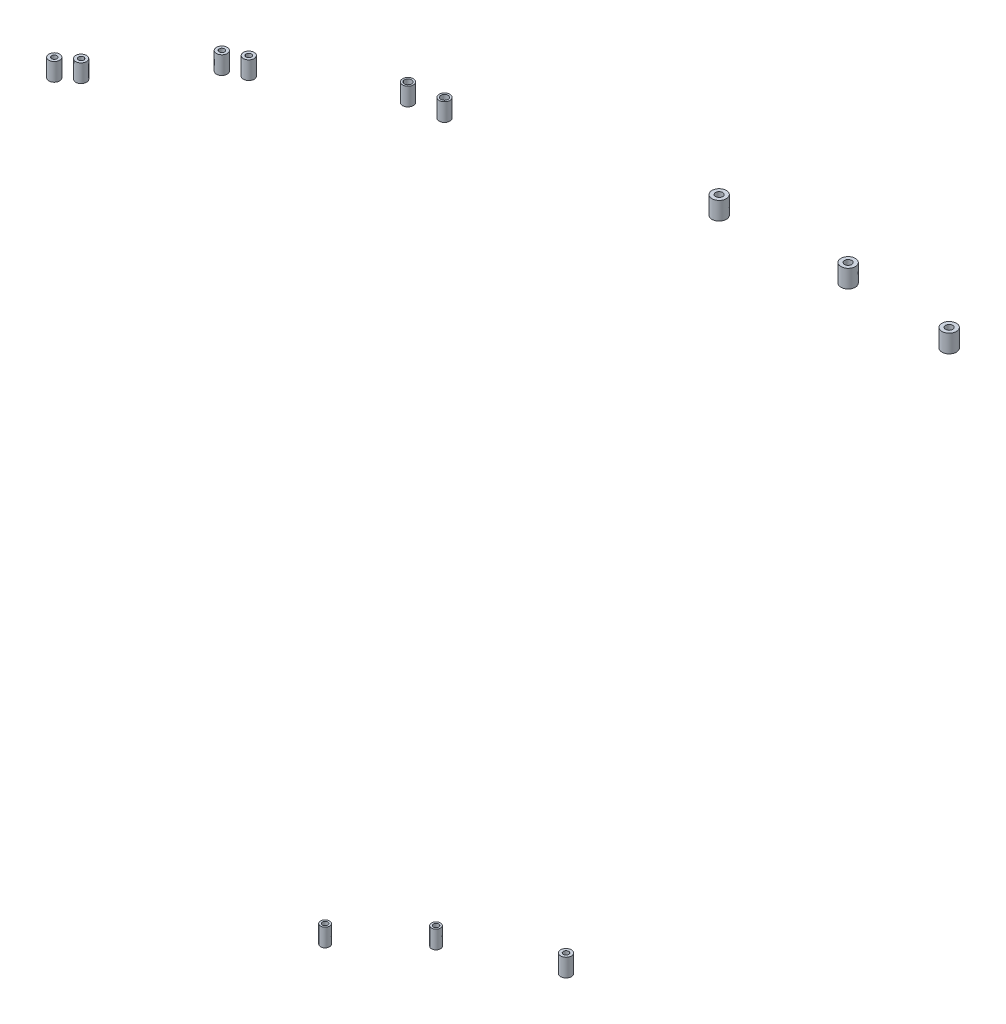
ISO-10303-21;
HEADER;
FILE_DESCRIPTION(('STEP AP214'),'2;1');
FILE_NAME('part.step','',(''),(''),'','','');
FILE_SCHEMA(('AUTOMOTIVE_DESIGN { 1 0 10303 214 1 1 1 1 }'));
ENDSEC;
DATA;
#1=APPLICATION_CONTEXT('core data for automotive mechanical design processes');
#2=APPLICATION_PROTOCOL_DEFINITION('international standard','automotive_design',2000,#1);
#3=PRODUCT_CONTEXT('',#1,'mechanical');
#4=PRODUCT('Part','Part','',(#3));
#5=PRODUCT_RELATED_PRODUCT_CATEGORY('part','',(#4));
#6=PRODUCT_DEFINITION_FORMATION('','',#4);
#7=PRODUCT_DEFINITION_CONTEXT('part definition',#1,'design');
#8=PRODUCT_DEFINITION('design','',#6,#7);
#9=PRODUCT_DEFINITION_SHAPE('','',#8);
#10=(LENGTH_UNIT() NAMED_UNIT(*) SI_UNIT(.MILLI.,.METRE.));
#11=(NAMED_UNIT(*) PLANE_ANGLE_UNIT() SI_UNIT($,.RADIAN.));
#12=(NAMED_UNIT(*) SI_UNIT($,.STERADIAN.) SOLID_ANGLE_UNIT());
#13=UNCERTAINTY_MEASURE_WITH_UNIT(LENGTH_MEASURE(1.E-05),#10,'distance_accuracy_value','');
#14=(GEOMETRIC_REPRESENTATION_CONTEXT(3) GLOBAL_UNCERTAINTY_ASSIGNED_CONTEXT((#13)) GLOBAL_UNIT_ASSIGNED_CONTEXT((#10,
#11,#12)) REPRESENTATION_CONTEXT('',''));
#15=CARTESIAN_POINT('',(0.,0.,0.));
#16=DIRECTION('',(0.,0.,1.));
#17=DIRECTION('',(1.,0.,0.));
#18=AXIS2_PLACEMENT_3D('',#15,#16,#17);
#19=CARTESIAN_POINT('',(-289.687055909534,300.199999999995,282.424125212581));
#20=DIRECTION('',(0.,1.,-1.00971538177767E-12));
#21=DIRECTION('',(0.,1.00971538177767E-12,1.));
#22=AXIS2_PLACEMENT_3D('',#19,#20,#21);
#23=CYLINDRICAL_SURFACE('',#22,2.99999999999999);
#24=CARTESIAN_POINT('',(-289.687055909534,300.199999999995,282.424125212581));
#25=DIRECTION('',(0.,1.,-1.00971538177767E-12));
#26=DIRECTION('',(0.,1.00971538177767E-12,1.));
#27=AXIS2_PLACEMENT_3D('',#24,#25,#26);
#28=CIRCLE('',#27,2.99999999999999);
#29=CARTESIAN_POINT('',(-289.687055909534,300.199999999998,285.424125212581));
#30=VERTEX_POINT('',#29);
#31=EDGE_CURVE('E11',#30,#30,#28,.T.);
#32=ORIENTED_EDGE('',*,*,#31,.T.);
#33=EDGE_LOOP('',(#32));
#34=FACE_BOUND('',#33,.T.);
#35=CARTESIAN_POINT('',(-289.687055909534,310.199999999995,282.424125212571));
#36=DIRECTION('',(0.,1.,-1.00971538177767E-12));
#37=DIRECTION('',(0.,1.00971538177767E-12,1.));
#38=AXIS2_PLACEMENT_3D('',#35,#36,#37);
#39=CIRCLE('',#38,2.99999999999999);
#40=CARTESIAN_POINT('',(-289.687055909534,310.199999999998,285.424125212571));
#41=VERTEX_POINT('',#40);
#42=EDGE_CURVE('E44',#41,#41,#39,.T.);
#43=ORIENTED_EDGE('',*,*,#42,.F.);
#44=EDGE_LOOP('',(#43));
#45=FACE_BOUND('',#44,.T.);
#46=ADVANCED_FACE('F41',(#34,#45),#23,.T.);
#47=CARTESIAN_POINT('',(-289.687055909534,300.199999999995,282.424125212581));
#48=DIRECTION('',(0.,1.,-1.00971538177767E-12));
#49=DIRECTION('',(0.,1.00971538177767E-12,1.));
#50=AXIS2_PLACEMENT_3D('',#47,#48,#49);
#51=PLANE('',#50);
#52=CARTESIAN_POINT('',(-289.687055909534,300.199999999995,282.424125212581));
#53=DIRECTION('',(0.,1.,-1.00971538177767E-12));
#54=DIRECTION('',(0.,1.00971538177767E-12,1.));
#55=AXIS2_PLACEMENT_3D('',#52,#53,#54);
#56=CIRCLE('',#55,1.50000000000002);
#57=CARTESIAN_POINT('',(-289.687055909534,300.199999999997,283.924125212581));
#58=VERTEX_POINT('',#57);
#59=EDGE_CURVE('E51',#58,#58,#56,.T.);
#60=ORIENTED_EDGE('',*,*,#59,.T.);
#61=EDGE_LOOP('',(#60));
#62=FACE_BOUND('',#61,.T.);
#63=ORIENTED_EDGE('',*,*,#31,.F.);
#64=EDGE_LOOP('',(#63));
#65=FACE_BOUND('',#64,.T.);
#66=ADVANCED_FACE('F59',(#62,#65),#51,.F.);
#67=CARTESIAN_POINT('',(-289.687055909534,310.199999999995,282.424125212571));
#68=DIRECTION('',(0.,1.,-1.00971538177767E-12));
#69=DIRECTION('',(0.,1.00971538177767E-12,1.));
#70=AXIS2_PLACEMENT_3D('',#67,#68,#69);
#71=PLANE('',#70);
#72=CARTESIAN_POINT('',(-289.687055909534,310.199999999995,282.424125212571));
#73=DIRECTION('',(0.,1.,-1.00971538177767E-12));
#74=DIRECTION('',(0.,1.00971538177767E-12,1.));
#75=AXIS2_PLACEMENT_3D('',#72,#73,#74);
#76=CIRCLE('',#75,1.50000000000002);
#77=CARTESIAN_POINT('',(-289.687055909534,310.199999999997,283.924125212571));
#78=VERTEX_POINT('',#77);
#79=EDGE_CURVE('E53',#78,#78,#76,.T.);
#80=ORIENTED_EDGE('',*,*,#79,.F.);
#81=EDGE_LOOP('',(#80));
#82=FACE_BOUND('',#81,.T.);
#83=ORIENTED_EDGE('',*,*,#42,.T.);
#84=EDGE_LOOP('',(#83));
#85=FACE_BOUND('',#84,.T.);
#86=ADVANCED_FACE('F65',(#82,#85),#71,.T.);
#87=CARTESIAN_POINT('',(-289.687055909534,300.199999999995,282.424125212581));
#88=DIRECTION('',(0.,1.,-1.00971538177767E-12));
#89=DIRECTION('',(0.,1.00971538177767E-12,1.));
#90=AXIS2_PLACEMENT_3D('',#87,#88,#89);
#91=CYLINDRICAL_SURFACE('',#90,1.50000000000002);
#92=ORIENTED_EDGE('',*,*,#59,.F.);
#93=EDGE_LOOP('',(#92));
#94=FACE_BOUND('',#93,.T.);
#95=ORIENTED_EDGE('',*,*,#79,.T.);
#96=EDGE_LOOP('',(#95));
#97=FACE_BOUND('',#96,.T.);
#98=ADVANCED_FACE('F62',(#94,#97),#91,.F.);
#99=CLOSED_SHELL('',(#46,#66,#86,#98));
#100=MANIFOLD_SOLID_BREP('B2',#99);
#101=CARTESIAN_POINT('',(-339.082998520851,300.200000000017,305.429754445419));
#102=DIRECTION('',(0.,1.,-1.00971538177767E-12));
#103=DIRECTION('',(0.,1.00971538177767E-12,1.));
#104=AXIS2_PLACEMENT_3D('',#101,#102,#103);
#105=CYLINDRICAL_SURFACE('',#104,2.50000000000002);
#106=CARTESIAN_POINT('',(-339.082998520851,300.200000000017,305.429754445419));
#107=DIRECTION('',(0.,1.,-1.00971538177767E-12));
#108=DIRECTION('',(0.,1.00971538177767E-12,1.));
#109=AXIS2_PLACEMENT_3D('',#106,#107,#108);
#110=CIRCLE('',#109,2.50000000000002);
#111=CARTESIAN_POINT('',(-339.082998520851,300.200000000019,307.929754445419));
#112=VERTEX_POINT('',#111);
#113=EDGE_CURVE('E40',#112,#112,#110,.T.);
#114=ORIENTED_EDGE('',*,*,#113,.T.);
#115=EDGE_LOOP('',(#114));
#116=FACE_BOUND('',#115,.T.);
#117=CARTESIAN_POINT('',(-339.082998520851,310.200000000017,305.429754445409));
#118=DIRECTION('',(0.,1.,-1.00971538177767E-12));
#119=DIRECTION('',(0.,1.00971538177767E-12,1.));
#120=AXIS2_PLACEMENT_3D('',#117,#118,#119);
#121=CIRCLE('',#120,2.50000000000002);
#122=CARTESIAN_POINT('',(-339.082998520851,310.200000000019,307.929754445409));
#123=VERTEX_POINT('',#122);
#124=EDGE_CURVE('E113',#123,#123,#121,.T.);
#125=ORIENTED_EDGE('',*,*,#124,.F.);
#126=EDGE_LOOP('',(#125));
#127=FACE_BOUND('',#126,.T.);
#128=ADVANCED_FACE('F110',(#116,#127),#105,.T.);
#129=CARTESIAN_POINT('',(-339.082998520851,300.200000000017,305.429754445419));
#130=DIRECTION('',(0.,1.,-1.00971538177767E-12));
#131=DIRECTION('',(0.,1.00971538177767E-12,1.));
#132=AXIS2_PLACEMENT_3D('',#129,#130,#131);
#133=PLANE('',#132);
#134=CARTESIAN_POINT('',(-339.082998520851,300.200000000017,305.429754445419));
#135=DIRECTION('',(0.,1.,-1.00971538177767E-12));
#136=DIRECTION('',(0.,1.00971538177767E-12,1.));
#137=AXIS2_PLACEMENT_3D('',#134,#135,#136);
#138=CIRCLE('',#137,1.50000000000002);
#139=CARTESIAN_POINT('',(-339.082998520851,300.200000000018,306.929754445419));
#140=VERTEX_POINT('',#139);
#141=EDGE_CURVE('E120',#140,#140,#138,.T.);
#142=ORIENTED_EDGE('',*,*,#141,.T.);
#143=EDGE_LOOP('',(#142));
#144=FACE_BOUND('',#143,.T.);
#145=ORIENTED_EDGE('',*,*,#113,.F.);
#146=EDGE_LOOP('',(#145));
#147=FACE_BOUND('',#146,.T.);
#148=ADVANCED_FACE('F128',(#144,#147),#133,.F.);
#149=CARTESIAN_POINT('',(-339.082998520851,310.200000000017,305.429754445409));
#150=DIRECTION('',(0.,1.,-1.00971538177767E-12));
#151=DIRECTION('',(0.,1.00971538177767E-12,1.));
#152=AXIS2_PLACEMENT_3D('',#149,#150,#151);
#153=PLANE('',#152);
#154=CARTESIAN_POINT('',(-339.082998520851,310.200000000017,305.429754445409));
#155=DIRECTION('',(0.,1.,-1.00971538177767E-12));
#156=DIRECTION('',(0.,1.00971538177767E-12,1.));
#157=AXIS2_PLACEMENT_3D('',#154,#155,#156);
#158=CIRCLE('',#157,1.50000000000002);
#159=CARTESIAN_POINT('',(-339.082998520851,310.200000000018,306.929754445409));
#160=VERTEX_POINT('',#159);
#161=EDGE_CURVE('E122',#160,#160,#158,.T.);
#162=ORIENTED_EDGE('',*,*,#161,.F.);
#163=EDGE_LOOP('',(#162));
#164=FACE_BOUND('',#163,.T.);
#165=ORIENTED_EDGE('',*,*,#124,.T.);
#166=EDGE_LOOP('',(#165));
#167=FACE_BOUND('',#166,.T.);
#168=ADVANCED_FACE('F134',(#164,#167),#153,.T.);
#169=CARTESIAN_POINT('',(-339.082998520851,300.200000000017,305.429754445419));
#170=DIRECTION('',(0.,1.,-1.00971538177767E-12));
#171=DIRECTION('',(0.,1.00971538177767E-12,1.));
#172=AXIS2_PLACEMENT_3D('',#169,#170,#171);
#173=CYLINDRICAL_SURFACE('',#172,1.50000000000002);
#174=ORIENTED_EDGE('',*,*,#141,.F.);
#175=EDGE_LOOP('',(#174));
#176=FACE_BOUND('',#175,.T.);
#177=ORIENTED_EDGE('',*,*,#161,.T.);
#178=EDGE_LOOP('',(#177));
#179=FACE_BOUND('',#178,.T.);
#180=ADVANCED_FACE('F131',(#176,#179),#173,.F.);
#181=CLOSED_SHELL('',(#128,#148,#168,#180));
#182=MANIFOLD_SOLID_BREP('B6',#181);
#183=CARTESIAN_POINT('',(-370.956911026411,300.200000000046,335.367132453129));
#184=DIRECTION('',(0.,1.,-1.00971538177767E-12));
#185=DIRECTION('',(0.,1.00971538177767E-12,1.));
#186=AXIS2_PLACEMENT_3D('',#183,#184,#185);
#187=CYLINDRICAL_SURFACE('',#186,2.50000000000002);
#188=CARTESIAN_POINT('',(-370.956911026411,300.200000000046,335.367132453129));
#189=DIRECTION('',(0.,1.,-1.00971538177767E-12));
#190=DIRECTION('',(0.,1.00971538177767E-12,1.));
#191=AXIS2_PLACEMENT_3D('',#188,#189,#190);
#192=CIRCLE('',#191,2.50000000000002);
#193=CARTESIAN_POINT('',(-370.956911026411,300.200000000049,337.867132453129));
#194=VERTEX_POINT('',#193);
#195=EDGE_CURVE('E109',#194,#194,#192,.T.);
#196=ORIENTED_EDGE('',*,*,#195,.T.);
#197=EDGE_LOOP('',(#196));
#198=FACE_BOUND('',#197,.T.);
#199=CARTESIAN_POINT('',(-370.956911026411,310.200000000046,335.367132453118));
#200=DIRECTION('',(0.,1.,-1.00971538177767E-12));
#201=DIRECTION('',(0.,1.00971538177767E-12,1.));
#202=AXIS2_PLACEMENT_3D('',#199,#200,#201);
#203=CIRCLE('',#202,2.50000000000002);
#204=CARTESIAN_POINT('',(-370.956911026411,310.200000000049,337.867132453118));
#205=VERTEX_POINT('',#204);
#206=EDGE_CURVE('E182',#205,#205,#203,.T.);
#207=ORIENTED_EDGE('',*,*,#206,.F.);
#208=EDGE_LOOP('',(#207));
#209=FACE_BOUND('',#208,.T.);
#210=ADVANCED_FACE('F179',(#198,#209),#187,.T.);
#211=CARTESIAN_POINT('',(-370.956911026411,300.200000000046,335.367132453129));
#212=DIRECTION('',(0.,1.,-1.00971538177767E-12));
#213=DIRECTION('',(0.,1.00971538177767E-12,1.));
#214=AXIS2_PLACEMENT_3D('',#211,#212,#213);
#215=PLANE('',#214);
#216=CARTESIAN_POINT('',(-370.956911026411,300.200000000046,335.367132453129));
#217=DIRECTION('',(0.,1.,-1.00971538177767E-12));
#218=DIRECTION('',(0.,1.00971538177767E-12,1.));
#219=AXIS2_PLACEMENT_3D('',#216,#217,#218);
#220=CIRCLE('',#219,1.50000000000002);
#221=CARTESIAN_POINT('',(-370.956911026411,300.200000000048,336.867132453129));
#222=VERTEX_POINT('',#221);
#223=EDGE_CURVE('E189',#222,#222,#220,.T.);
#224=ORIENTED_EDGE('',*,*,#223,.T.);
#225=EDGE_LOOP('',(#224));
#226=FACE_BOUND('',#225,.T.);
#227=ORIENTED_EDGE('',*,*,#195,.F.);
#228=EDGE_LOOP('',(#227));
#229=FACE_BOUND('',#228,.T.);
#230=ADVANCED_FACE('F197',(#226,#229),#215,.F.);
#231=CARTESIAN_POINT('',(-370.956911026411,310.200000000046,335.367132453118));
#232=DIRECTION('',(0.,1.,-1.00971538177767E-12));
#233=DIRECTION('',(0.,1.00971538177767E-12,1.));
#234=AXIS2_PLACEMENT_3D('',#231,#232,#233);
#235=PLANE('',#234);
#236=CARTESIAN_POINT('',(-370.956911026411,310.200000000046,335.367132453118));
#237=DIRECTION('',(0.,1.,-1.00971538177767E-12));
#238=DIRECTION('',(0.,1.00971538177767E-12,1.));
#239=AXIS2_PLACEMENT_3D('',#236,#237,#238);
#240=CIRCLE('',#239,1.50000000000002);
#241=CARTESIAN_POINT('',(-370.956911026411,310.200000000048,336.867132453118));
#242=VERTEX_POINT('',#241);
#243=EDGE_CURVE('E191',#242,#242,#240,.T.);
#244=ORIENTED_EDGE('',*,*,#243,.F.);
#245=EDGE_LOOP('',(#244));
#246=FACE_BOUND('',#245,.T.);
#247=ORIENTED_EDGE('',*,*,#206,.T.);
#248=EDGE_LOOP('',(#247));
#249=FACE_BOUND('',#248,.T.);
#250=ADVANCED_FACE('F203',(#246,#249),#235,.T.);
#251=CARTESIAN_POINT('',(-370.956911026411,300.200000000046,335.367132453129));
#252=DIRECTION('',(0.,1.,-1.00971538177767E-12));
#253=DIRECTION('',(0.,1.00971538177767E-12,1.));
#254=AXIS2_PLACEMENT_3D('',#251,#252,#253);
#255=CYLINDRICAL_SURFACE('',#254,1.50000000000002);
#256=ORIENTED_EDGE('',*,*,#223,.F.);
#257=EDGE_LOOP('',(#256));
#258=FACE_BOUND('',#257,.T.);
#259=ORIENTED_EDGE('',*,*,#243,.T.);
#260=EDGE_LOOP('',(#259));
#261=FACE_BOUND('',#260,.T.);
#262=ADVANCED_FACE('F200',(#258,#261),#255,.F.);
#263=CLOSED_SHELL('',(#210,#230,#250,#262));
#264=MANIFOLD_SOLID_BREP('B35',#263);
#265=CARTESIAN_POINT('',(-94.9095215443751,690.,263.802212935845));
#266=DIRECTION('',(0.,1.,0.));
#267=DIRECTION('',(0.,0.,1.));
#268=AXIS2_PLACEMENT_3D('',#265,#266,#267);
#269=CYLINDRICAL_SURFACE('',#268,4.00000000000001);
#270=CARTESIAN_POINT('',(-94.9095215443751,690.,263.802212935845));
#271=DIRECTION('',(0.,1.,0.));
#272=DIRECTION('',(0.,0.,1.));
#273=AXIS2_PLACEMENT_3D('',#270,#271,#272);
#274=CIRCLE('',#273,4.00000000000001);
#275=CARTESIAN_POINT('',(-94.9095215443751,690.,267.802212935845));
#276=VERTEX_POINT('',#275);
#277=EDGE_CURVE('E178',#276,#276,#274,.T.);
#278=ORIENTED_EDGE('',*,*,#277,.T.);
#279=EDGE_LOOP('',(#278));
#280=FACE_BOUND('',#279,.T.);
#281=CARTESIAN_POINT('',(-94.9095215443751,700.,263.802212935845));
#282=DIRECTION('',(0.,1.,0.));
#283=DIRECTION('',(0.,0.,1.));
#284=AXIS2_PLACEMENT_3D('',#281,#282,#283);
#285=CIRCLE('',#284,4.00000000000001);
#286=CARTESIAN_POINT('',(-94.9095215443751,700.,267.802212935845));
#287=VERTEX_POINT('',#286);
#288=EDGE_CURVE('E251',#287,#287,#285,.T.);
#289=ORIENTED_EDGE('',*,*,#288,.F.);
#290=EDGE_LOOP('',(#289));
#291=FACE_BOUND('',#290,.T.);
#292=ADVANCED_FACE('F248',(#280,#291),#269,.T.);
#293=CARTESIAN_POINT('',(-94.9095215443751,690.,263.802212935845));
#294=DIRECTION('',(0.,1.,0.));
#295=DIRECTION('',(0.,0.,1.));
#296=AXIS2_PLACEMENT_3D('',#293,#294,#295);
#297=PLANE('',#296);
#298=CARTESIAN_POINT('',(-94.9095215443751,690.,263.802212935845));
#299=DIRECTION('',(0.,1.,0.));
#300=DIRECTION('',(0.,0.,1.));
#301=AXIS2_PLACEMENT_3D('',#298,#299,#300);
#302=CIRCLE('',#301,2.);
#303=CARTESIAN_POINT('',(-94.9095215443751,690.,265.802212935845));
#304=VERTEX_POINT('',#303);
#305=EDGE_CURVE('E258',#304,#304,#302,.T.);
#306=ORIENTED_EDGE('',*,*,#305,.T.);
#307=EDGE_LOOP('',(#306));
#308=FACE_BOUND('',#307,.T.);
#309=ORIENTED_EDGE('',*,*,#277,.F.);
#310=EDGE_LOOP('',(#309));
#311=FACE_BOUND('',#310,.T.);
#312=ADVANCED_FACE('F266',(#308,#311),#297,.F.);
#313=CARTESIAN_POINT('',(-94.9095215443751,700.,263.802212935845));
#314=DIRECTION('',(0.,1.,0.));
#315=DIRECTION('',(0.,0.,1.));
#316=AXIS2_PLACEMENT_3D('',#313,#314,#315);
#317=PLANE('',#316);
#318=CARTESIAN_POINT('',(-94.9095215443751,700.,263.802212935845));
#319=DIRECTION('',(0.,1.,0.));
#320=DIRECTION('',(0.,0.,1.));
#321=AXIS2_PLACEMENT_3D('',#318,#319,#320);
#322=CIRCLE('',#321,2.);
#323=CARTESIAN_POINT('',(-94.9095215443751,700.,265.802212935845));
#324=VERTEX_POINT('',#323);
#325=EDGE_CURVE('E260',#324,#324,#322,.T.);
#326=ORIENTED_EDGE('',*,*,#325,.F.);
#327=EDGE_LOOP('',(#326));
#328=FACE_BOUND('',#327,.T.);
#329=ORIENTED_EDGE('',*,*,#288,.T.);
#330=EDGE_LOOP('',(#329));
#331=FACE_BOUND('',#330,.T.);
#332=ADVANCED_FACE('F272',(#328,#331),#317,.T.);
#333=CARTESIAN_POINT('',(-94.9095215443751,690.,263.802212935845));
#334=DIRECTION('',(0.,1.,0.));
#335=DIRECTION('',(0.,0.,1.));
#336=AXIS2_PLACEMENT_3D('',#333,#334,#335);
#337=CYLINDRICAL_SURFACE('',#336,2.);
#338=ORIENTED_EDGE('',*,*,#305,.F.);
#339=EDGE_LOOP('',(#338));
#340=FACE_BOUND('',#339,.T.);
#341=ORIENTED_EDGE('',*,*,#325,.T.);
#342=EDGE_LOOP('',(#341));
#343=FACE_BOUND('',#342,.T.);
#344=ADVANCED_FACE('F269',(#340,#343),#337,.F.);
#345=CLOSED_SHELL('',(#292,#312,#332,#344));
#346=MANIFOLD_SOLID_BREP('B104',#345);
#347=CARTESIAN_POINT('',(-154.344703344319,690.,260.643821632466));
#348=DIRECTION('',(0.,1.,0.));
#349=DIRECTION('',(0.,0.,1.));
#350=AXIS2_PLACEMENT_3D('',#347,#348,#349);
#351=CYLINDRICAL_SURFACE('',#350,3.99999999999999);
#352=CARTESIAN_POINT('',(-154.344703344319,690.,260.643821632466));
#353=DIRECTION('',(0.,1.,0.));
#354=DIRECTION('',(0.,0.,1.));
#355=AXIS2_PLACEMENT_3D('',#352,#353,#354);
#356=CIRCLE('',#355,3.99999999999999);
#357=CARTESIAN_POINT('',(-154.344703344319,690.,264.643821632466));
#358=VERTEX_POINT('',#357);
#359=EDGE_CURVE('E247',#358,#358,#356,.T.);
#360=ORIENTED_EDGE('',*,*,#359,.T.);
#361=EDGE_LOOP('',(#360));
#362=FACE_BOUND('',#361,.T.);
#363=CARTESIAN_POINT('',(-154.344703344319,700.,260.643821632466));
#364=DIRECTION('',(0.,1.,0.));
#365=DIRECTION('',(0.,0.,1.));
#366=AXIS2_PLACEMENT_3D('',#363,#364,#365);
#367=CIRCLE('',#366,3.99999999999999);
#368=CARTESIAN_POINT('',(-154.344703344319,700.,264.643821632466));
#369=VERTEX_POINT('',#368);
#370=EDGE_CURVE('E320',#369,#369,#367,.T.);
#371=ORIENTED_EDGE('',*,*,#370,.F.);
#372=EDGE_LOOP('',(#371));
#373=FACE_BOUND('',#372,.T.);
#374=ADVANCED_FACE('F317',(#362,#373),#351,.T.);
#375=CARTESIAN_POINT('',(-154.344703344319,690.,260.643821632466));
#376=DIRECTION('',(0.,1.,0.));
#377=DIRECTION('',(0.,0.,1.));
#378=AXIS2_PLACEMENT_3D('',#375,#376,#377);
#379=PLANE('',#378);
#380=CARTESIAN_POINT('',(-154.344703344319,690.,260.643821632466));
#381=DIRECTION('',(0.,1.,0.));
#382=DIRECTION('',(0.,0.,1.));
#383=AXIS2_PLACEMENT_3D('',#380,#381,#382);
#384=CIRCLE('',#383,2.);
#385=CARTESIAN_POINT('',(-154.344703344319,690.,262.643821632466));
#386=VERTEX_POINT('',#385);
#387=EDGE_CURVE('E327',#386,#386,#384,.T.);
#388=ORIENTED_EDGE('',*,*,#387,.T.);
#389=EDGE_LOOP('',(#388));
#390=FACE_BOUND('',#389,.T.);
#391=ORIENTED_EDGE('',*,*,#359,.F.);
#392=EDGE_LOOP('',(#391));
#393=FACE_BOUND('',#392,.T.);
#394=ADVANCED_FACE('F335',(#390,#393),#379,.F.);
#395=CARTESIAN_POINT('',(-154.344703344319,700.,260.643821632466));
#396=DIRECTION('',(0.,1.,0.));
#397=DIRECTION('',(0.,0.,1.));
#398=AXIS2_PLACEMENT_3D('',#395,#396,#397);
#399=PLANE('',#398);
#400=CARTESIAN_POINT('',(-154.344703344319,700.,260.643821632466));
#401=DIRECTION('',(0.,1.,0.));
#402=DIRECTION('',(0.,0.,1.));
#403=AXIS2_PLACEMENT_3D('',#400,#401,#402);
#404=CIRCLE('',#403,2.);
#405=CARTESIAN_POINT('',(-154.344703344319,700.,262.643821632466));
#406=VERTEX_POINT('',#405);
#407=EDGE_CURVE('E329',#406,#406,#404,.T.);
#408=ORIENTED_EDGE('',*,*,#407,.F.);
#409=EDGE_LOOP('',(#408));
#410=FACE_BOUND('',#409,.T.);
#411=ORIENTED_EDGE('',*,*,#370,.T.);
#412=EDGE_LOOP('',(#411));
#413=FACE_BOUND('',#412,.T.);
#414=ADVANCED_FACE('F341',(#410,#413),#399,.T.);
#415=CARTESIAN_POINT('',(-154.344703344319,690.,260.643821632466));
#416=DIRECTION('',(0.,1.,0.));
#417=DIRECTION('',(0.,0.,1.));
#418=AXIS2_PLACEMENT_3D('',#415,#416,#417);
#419=CYLINDRICAL_SURFACE('',#418,2.);
#420=ORIENTED_EDGE('',*,*,#387,.F.);
#421=EDGE_LOOP('',(#420));
#422=FACE_BOUND('',#421,.T.);
#423=ORIENTED_EDGE('',*,*,#407,.T.);
#424=EDGE_LOOP('',(#423));
#425=FACE_BOUND('',#424,.T.);
#426=ADVANCED_FACE('F338',(#422,#425),#419,.F.);
#427=CLOSED_SHELL('',(#374,#394,#414,#426));
#428=MANIFOLD_SOLID_BREP('B173',#427);
#429=CARTESIAN_POINT('',(-223.024834580686,690.,263.802212935845));
#430=DIRECTION('',(0.,1.,0.));
#431=DIRECTION('',(0.,0.,1.));
#432=AXIS2_PLACEMENT_3D('',#429,#430,#431);
#433=CYLINDRICAL_SURFACE('',#432,3.99999999999999);
#434=CARTESIAN_POINT('',(-223.024834580686,690.,263.802212935845));
#435=DIRECTION('',(0.,1.,0.));
#436=DIRECTION('',(0.,0.,1.));
#437=AXIS2_PLACEMENT_3D('',#434,#435,#436);
#438=CIRCLE('',#437,3.99999999999999);
#439=CARTESIAN_POINT('',(-223.024834580686,690.,267.802212935845));
#440=VERTEX_POINT('',#439);
#441=EDGE_CURVE('E316',#440,#440,#438,.T.);
#442=ORIENTED_EDGE('',*,*,#441,.T.);
#443=EDGE_LOOP('',(#442));
#444=FACE_BOUND('',#443,.T.);
#445=CARTESIAN_POINT('',(-223.024834580686,700.,263.802212935845));
#446=DIRECTION('',(0.,1.,0.));
#447=DIRECTION('',(0.,0.,1.));
#448=AXIS2_PLACEMENT_3D('',#445,#446,#447);
#449=CIRCLE('',#448,3.99999999999999);
#450=CARTESIAN_POINT('',(-223.024834580686,700.,267.802212935845));
#451=VERTEX_POINT('',#450);
#452=EDGE_CURVE('E389',#451,#451,#449,.T.);
#453=ORIENTED_EDGE('',*,*,#452,.F.);
#454=EDGE_LOOP('',(#453));
#455=FACE_BOUND('',#454,.T.);
#456=ADVANCED_FACE('F386',(#444,#455),#433,.T.);
#457=CARTESIAN_POINT('',(-223.024834580686,690.,263.802212935845));
#458=DIRECTION('',(0.,1.,0.));
#459=DIRECTION('',(0.,0.,1.));
#460=AXIS2_PLACEMENT_3D('',#457,#458,#459);
#461=PLANE('',#460);
#462=CARTESIAN_POINT('',(-223.024834580686,690.,263.802212935845));
#463=DIRECTION('',(0.,1.,0.));
#464=DIRECTION('',(0.,0.,1.));
#465=AXIS2_PLACEMENT_3D('',#462,#463,#464);
#466=CIRCLE('',#465,2.);
#467=CARTESIAN_POINT('',(-223.024834580686,690.,265.802212935845));
#468=VERTEX_POINT('',#467);
#469=EDGE_CURVE('E396',#468,#468,#466,.T.);
#470=ORIENTED_EDGE('',*,*,#469,.T.);
#471=EDGE_LOOP('',(#470));
#472=FACE_BOUND('',#471,.T.);
#473=ORIENTED_EDGE('',*,*,#441,.F.);
#474=EDGE_LOOP('',(#473));
#475=FACE_BOUND('',#474,.T.);
#476=ADVANCED_FACE('F404',(#472,#475),#461,.F.);
#477=CARTESIAN_POINT('',(-223.024834580686,700.,263.802212935845));
#478=DIRECTION('',(0.,1.,0.));
#479=DIRECTION('',(0.,0.,1.));
#480=AXIS2_PLACEMENT_3D('',#477,#478,#479);
#481=PLANE('',#480);
#482=CARTESIAN_POINT('',(-223.024834580686,700.,263.802212935845));
#483=DIRECTION('',(0.,1.,0.));
#484=DIRECTION('',(0.,0.,1.));
#485=AXIS2_PLACEMENT_3D('',#482,#483,#484);
#486=CIRCLE('',#485,2.);
#487=CARTESIAN_POINT('',(-223.024834580686,700.,265.802212935845));
#488=VERTEX_POINT('',#487);
#489=EDGE_CURVE('E398',#488,#488,#486,.T.);
#490=ORIENTED_EDGE('',*,*,#489,.F.);
#491=EDGE_LOOP('',(#490));
#492=FACE_BOUND('',#491,.T.);
#493=ORIENTED_EDGE('',*,*,#452,.T.);
#494=EDGE_LOOP('',(#493));
#495=FACE_BOUND('',#494,.T.);
#496=ADVANCED_FACE('F410',(#492,#495),#481,.T.);
#497=CARTESIAN_POINT('',(-223.024834580686,690.,263.802212935845));
#498=DIRECTION('',(0.,1.,0.));
#499=DIRECTION('',(0.,0.,1.));
#500=AXIS2_PLACEMENT_3D('',#497,#498,#499);
#501=CYLINDRICAL_SURFACE('',#500,2.);
#502=ORIENTED_EDGE('',*,*,#469,.F.);
#503=EDGE_LOOP('',(#502));
#504=FACE_BOUND('',#503,.T.);
#505=ORIENTED_EDGE('',*,*,#489,.T.);
#506=EDGE_LOOP('',(#505));
#507=FACE_BOUND('',#506,.T.);
#508=ADVANCED_FACE('F407',(#504,#507),#501,.F.);
#509=CLOSED_SHELL('',(#456,#476,#496,#508));
#510=MANIFOLD_SOLID_BREP('B242',#509);
#511=CARTESIAN_POINT('',(-346.389872513205,690.,293.396246383283));
#512=DIRECTION('',(0.,1.,0.));
#513=DIRECTION('',(0.,0.,1.));
#514=AXIS2_PLACEMENT_3D('',#511,#512,#513);
#515=CYLINDRICAL_SURFACE('',#514,2.99999999999999);
#516=CARTESIAN_POINT('',(-346.389872513205,690.,293.396246383283));
#517=DIRECTION('',(0.,1.,0.));
#518=DIRECTION('',(0.,0.,1.));
#519=AXIS2_PLACEMENT_3D('',#516,#517,#518);
#520=CIRCLE('',#519,2.99999999999999);
#521=CARTESIAN_POINT('',(-346.389872513205,690.,296.396246383283));
#522=VERTEX_POINT('',#521);
#523=EDGE_CURVE('E385',#522,#522,#520,.T.);
#524=ORIENTED_EDGE('',*,*,#523,.T.);
#525=EDGE_LOOP('',(#524));
#526=FACE_BOUND('',#525,.T.);
#527=CARTESIAN_POINT('',(-346.389872513205,700.,293.396246383283));
#528=DIRECTION('',(0.,1.,0.));
#529=DIRECTION('',(0.,0.,1.));
#530=AXIS2_PLACEMENT_3D('',#527,#528,#529);
#531=CIRCLE('',#530,2.99999999999999);
#532=CARTESIAN_POINT('',(-346.389872513205,700.,296.396246383283));
#533=VERTEX_POINT('',#532);
#534=EDGE_CURVE('E458',#533,#533,#531,.T.);
#535=ORIENTED_EDGE('',*,*,#534,.F.);
#536=EDGE_LOOP('',(#535));
#537=FACE_BOUND('',#536,.T.);
#538=ADVANCED_FACE('F455',(#526,#537),#515,.T.);
#539=CARTESIAN_POINT('',(-346.389872513205,690.,293.396246383283));
#540=DIRECTION('',(0.,1.,0.));
#541=DIRECTION('',(0.,0.,1.));
#542=AXIS2_PLACEMENT_3D('',#539,#540,#541);
#543=PLANE('',#542);
#544=CARTESIAN_POINT('',(-346.389872513205,690.,293.396246383283));
#545=DIRECTION('',(0.,1.,0.));
#546=DIRECTION('',(0.,0.,1.));
#547=AXIS2_PLACEMENT_3D('',#544,#545,#546);
#548=CIRCLE('',#547,2.);
#549=CARTESIAN_POINT('',(-346.389872513205,690.,295.396246383283));
#550=VERTEX_POINT('',#549);
#551=EDGE_CURVE('E465',#550,#550,#548,.T.);
#552=ORIENTED_EDGE('',*,*,#551,.T.);
#553=EDGE_LOOP('',(#552));
#554=FACE_BOUND('',#553,.T.);
#555=ORIENTED_EDGE('',*,*,#523,.F.);
#556=EDGE_LOOP('',(#555));
#557=FACE_BOUND('',#556,.T.);
#558=ADVANCED_FACE('F473',(#554,#557),#543,.F.);
#559=CARTESIAN_POINT('',(-346.389872513205,700.,293.396246383283));
#560=DIRECTION('',(0.,1.,0.));
#561=DIRECTION('',(0.,0.,1.));
#562=AXIS2_PLACEMENT_3D('',#559,#560,#561);
#563=PLANE('',#562);
#564=CARTESIAN_POINT('',(-346.389872513205,700.,293.396246383283));
#565=DIRECTION('',(0.,1.,0.));
#566=DIRECTION('',(0.,0.,1.));
#567=AXIS2_PLACEMENT_3D('',#564,#565,#566);
#568=CIRCLE('',#567,2.);
#569=CARTESIAN_POINT('',(-346.389872513205,700.,295.396246383283));
#570=VERTEX_POINT('',#569);
#571=EDGE_CURVE('E467',#570,#570,#568,.T.);
#572=ORIENTED_EDGE('',*,*,#571,.F.);
#573=EDGE_LOOP('',(#572));
#574=FACE_BOUND('',#573,.T.);
#575=ORIENTED_EDGE('',*,*,#534,.T.);
#576=EDGE_LOOP('',(#575));
#577=FACE_BOUND('',#576,.T.);
#578=ADVANCED_FACE('F479',(#574,#577),#563,.T.);
#579=CARTESIAN_POINT('',(-346.389872513205,690.,293.396246383283));
#580=DIRECTION('',(0.,1.,0.));
#581=DIRECTION('',(0.,0.,1.));
#582=AXIS2_PLACEMENT_3D('',#579,#580,#581);
#583=CYLINDRICAL_SURFACE('',#582,2.);
#584=ORIENTED_EDGE('',*,*,#551,.F.);
#585=EDGE_LOOP('',(#584));
#586=FACE_BOUND('',#585,.T.);
#587=ORIENTED_EDGE('',*,*,#571,.T.);
#588=EDGE_LOOP('',(#587));
#589=FACE_BOUND('',#588,.T.);
#590=ADVANCED_FACE('F476',(#586,#589),#583,.F.);
#591=CLOSED_SHELL('',(#538,#558,#578,#590));
#592=MANIFOLD_SOLID_BREP('B311',#591);
#593=CARTESIAN_POINT('',(-364.051137420954,690.,296.101801858513));
#594=DIRECTION('',(0.,1.,0.));
#595=DIRECTION('',(0.,0.,1.));
#596=AXIS2_PLACEMENT_3D('',#593,#594,#595);
#597=CYLINDRICAL_SURFACE('',#596,2.99999999999999);
#598=CARTESIAN_POINT('',(-364.051137420954,690.,296.101801858513));
#599=DIRECTION('',(0.,1.,0.));
#600=DIRECTION('',(0.,0.,1.));
#601=AXIS2_PLACEMENT_3D('',#598,#599,#600);
#602=CIRCLE('',#601,2.99999999999999);
#603=CARTESIAN_POINT('',(-364.051137420954,690.,299.101801858513));
#604=VERTEX_POINT('',#603);
#605=EDGE_CURVE('E454',#604,#604,#602,.T.);
#606=ORIENTED_EDGE('',*,*,#605,.T.);
#607=EDGE_LOOP('',(#606));
#608=FACE_BOUND('',#607,.T.);
#609=CARTESIAN_POINT('',(-364.051137420954,700.,296.101801858513));
#610=DIRECTION('',(0.,1.,0.));
#611=DIRECTION('',(0.,0.,1.));
#612=AXIS2_PLACEMENT_3D('',#609,#610,#611);
#613=CIRCLE('',#612,2.99999999999999);
#614=CARTESIAN_POINT('',(-364.051137420954,700.,299.101801858513));
#615=VERTEX_POINT('',#614);
#616=EDGE_CURVE('E527',#615,#615,#613,.T.);
#617=ORIENTED_EDGE('',*,*,#616,.F.);
#618=EDGE_LOOP('',(#617));
#619=FACE_BOUND('',#618,.T.);
#620=ADVANCED_FACE('F524',(#608,#619),#597,.T.);
#621=CARTESIAN_POINT('',(-364.051137420954,690.,296.101801858513));
#622=DIRECTION('',(0.,1.,0.));
#623=DIRECTION('',(0.,0.,1.));
#624=AXIS2_PLACEMENT_3D('',#621,#622,#623);
#625=PLANE('',#624);
#626=CARTESIAN_POINT('',(-364.051137420954,690.,296.101801858513));
#627=DIRECTION('',(0.,1.,0.));
#628=DIRECTION('',(0.,0.,1.));
#629=AXIS2_PLACEMENT_3D('',#626,#627,#628);
#630=CIRCLE('',#629,2.);
#631=CARTESIAN_POINT('',(-364.051137420954,690.,298.101801858513));
#632=VERTEX_POINT('',#631);
#633=EDGE_CURVE('E534',#632,#632,#630,.T.);
#634=ORIENTED_EDGE('',*,*,#633,.T.);
#635=EDGE_LOOP('',(#634));
#636=FACE_BOUND('',#635,.T.);
#637=ORIENTED_EDGE('',*,*,#605,.F.);
#638=EDGE_LOOP('',(#637));
#639=FACE_BOUND('',#638,.T.);
#640=ADVANCED_FACE('F542',(#636,#639),#625,.F.);
#641=CARTESIAN_POINT('',(-364.051137420954,700.,296.101801858513));
#642=DIRECTION('',(0.,1.,0.));
#643=DIRECTION('',(0.,0.,1.));
#644=AXIS2_PLACEMENT_3D('',#641,#642,#643);
#645=PLANE('',#644);
#646=CARTESIAN_POINT('',(-364.051137420954,700.,296.101801858513));
#647=DIRECTION('',(0.,1.,0.));
#648=DIRECTION('',(0.,0.,1.));
#649=AXIS2_PLACEMENT_3D('',#646,#647,#648);
#650=CIRCLE('',#649,2.);
#651=CARTESIAN_POINT('',(-364.051137420954,700.,298.101801858513));
#652=VERTEX_POINT('',#651);
#653=EDGE_CURVE('E536',#652,#652,#650,.T.);
#654=ORIENTED_EDGE('',*,*,#653,.F.);
#655=EDGE_LOOP('',(#654));
#656=FACE_BOUND('',#655,.T.);
#657=ORIENTED_EDGE('',*,*,#616,.T.);
#658=EDGE_LOOP('',(#657));
#659=FACE_BOUND('',#658,.T.);
#660=ADVANCED_FACE('F548',(#656,#659),#645,.T.);
#661=CARTESIAN_POINT('',(-364.051137420954,690.,296.101801858513));
#662=DIRECTION('',(0.,1.,0.));
#663=DIRECTION('',(0.,0.,1.));
#664=AXIS2_PLACEMENT_3D('',#661,#662,#663);
#665=CYLINDRICAL_SURFACE('',#664,2.);
#666=ORIENTED_EDGE('',*,*,#633,.F.);
#667=EDGE_LOOP('',(#666));
#668=FACE_BOUND('',#667,.T.);
#669=ORIENTED_EDGE('',*,*,#653,.T.);
#670=EDGE_LOOP('',(#669));
#671=FACE_BOUND('',#670,.T.);
#672=ADVANCED_FACE('F545',(#668,#671),#665,.F.);
#673=CLOSED_SHELL('',(#620,#640,#660,#672));
#674=MANIFOLD_SOLID_BREP('B380',#673);
#675=CARTESIAN_POINT('',(-421.090050281492,690.,327.725114351705));
#676=DIRECTION('',(0.,1.,0.));
#677=DIRECTION('',(0.,0.,1.));
#678=AXIS2_PLACEMENT_3D('',#675,#676,#677);
#679=CYLINDRICAL_SURFACE('',#678,2.99999999999999);
#680=CARTESIAN_POINT('',(-421.090050281492,690.,327.725114351705));
#681=DIRECTION('',(0.,1.,0.));
#682=DIRECTION('',(0.,0.,1.));
#683=AXIS2_PLACEMENT_3D('',#680,#681,#682);
#684=CIRCLE('',#683,2.99999999999999);
#685=CARTESIAN_POINT('',(-421.090050281492,690.,330.725114351705));
#686=VERTEX_POINT('',#685);
#687=EDGE_CURVE('E523',#686,#686,#684,.T.);
#688=ORIENTED_EDGE('',*,*,#687,.T.);
#689=EDGE_LOOP('',(#688));
#690=FACE_BOUND('',#689,.T.);
#691=CARTESIAN_POINT('',(-421.090050281492,700.,327.725114351705));
#692=DIRECTION('',(0.,1.,0.));
#693=DIRECTION('',(0.,0.,1.));
#694=AXIS2_PLACEMENT_3D('',#691,#692,#693);
#695=CIRCLE('',#694,2.99999999999999);
#696=CARTESIAN_POINT('',(-421.090050281492,700.,330.725114351705));
#697=VERTEX_POINT('',#696);
#698=EDGE_CURVE('E596',#697,#697,#695,.T.);
#699=ORIENTED_EDGE('',*,*,#698,.F.);
#700=EDGE_LOOP('',(#699));
#701=FACE_BOUND('',#700,.T.);
#702=ADVANCED_FACE('F593',(#690,#701),#679,.T.);
#703=CARTESIAN_POINT('',(-421.090050281492,690.,327.725114351705));
#704=DIRECTION('',(0.,1.,0.));
#705=DIRECTION('',(0.,0.,1.));
#706=AXIS2_PLACEMENT_3D('',#703,#704,#705);
#707=PLANE('',#706);
#708=CARTESIAN_POINT('',(-421.090050281492,690.,327.725114351705));
#709=DIRECTION('',(0.,1.,0.));
#710=DIRECTION('',(0.,0.,1.));
#711=AXIS2_PLACEMENT_3D('',#708,#709,#710);
#712=CIRCLE('',#711,1.50000000000002);
#713=CARTESIAN_POINT('',(-421.090050281492,690.,329.225114351705));
#714=VERTEX_POINT('',#713);
#715=EDGE_CURVE('E603',#714,#714,#712,.T.);
#716=ORIENTED_EDGE('',*,*,#715,.T.);
#717=EDGE_LOOP('',(#716));
#718=FACE_BOUND('',#717,.T.);
#719=ORIENTED_EDGE('',*,*,#687,.F.);
#720=EDGE_LOOP('',(#719));
#721=FACE_BOUND('',#720,.T.);
#722=ADVANCED_FACE('F611',(#718,#721),#707,.F.);
#723=CARTESIAN_POINT('',(-421.090050281492,700.,327.725114351705));
#724=DIRECTION('',(0.,1.,0.));
#725=DIRECTION('',(0.,0.,1.));
#726=AXIS2_PLACEMENT_3D('',#723,#724,#725);
#727=PLANE('',#726);
#728=CARTESIAN_POINT('',(-421.090050281492,700.,327.725114351705));
#729=DIRECTION('',(0.,1.,0.));
#730=DIRECTION('',(0.,0.,1.));
#731=AXIS2_PLACEMENT_3D('',#728,#729,#730);
#732=CIRCLE('',#731,1.50000000000002);
#733=CARTESIAN_POINT('',(-421.090050281492,700.,329.225114351705));
#734=VERTEX_POINT('',#733);
#735=EDGE_CURVE('E605',#734,#734,#732,.T.);
#736=ORIENTED_EDGE('',*,*,#735,.F.);
#737=EDGE_LOOP('',(#736));
#738=FACE_BOUND('',#737,.T.);
#739=ORIENTED_EDGE('',*,*,#698,.T.);
#740=EDGE_LOOP('',(#739));
#741=FACE_BOUND('',#740,.T.);
#742=ADVANCED_FACE('F617',(#738,#741),#727,.T.);
#743=CARTESIAN_POINT('',(-421.090050281492,690.,327.725114351705));
#744=DIRECTION('',(0.,1.,0.));
#745=DIRECTION('',(0.,0.,1.));
#746=AXIS2_PLACEMENT_3D('',#743,#744,#745);
#747=CYLINDRICAL_SURFACE('',#746,1.50000000000002);
#748=ORIENTED_EDGE('',*,*,#715,.F.);
#749=EDGE_LOOP('',(#748));
#750=FACE_BOUND('',#749,.T.);
#751=ORIENTED_EDGE('',*,*,#735,.T.);
#752=EDGE_LOOP('',(#751));
#753=FACE_BOUND('',#752,.T.);
#754=ADVANCED_FACE('F614',(#750,#753),#747,.F.);
#755=CLOSED_SHELL('',(#702,#722,#742,#754));
#756=MANIFOLD_SOLID_BREP('B449',#755);
#757=CARTESIAN_POINT('',(-431.039698401952,690.,332.774189517311));
#758=DIRECTION('',(0.,1.,0.));
#759=DIRECTION('',(0.,0.,1.));
#760=AXIS2_PLACEMENT_3D('',#757,#758,#759);
#761=CYLINDRICAL_SURFACE('',#760,2.99999999999999);
#762=CARTESIAN_POINT('',(-431.039698401952,690.,332.774189517311));
#763=DIRECTION('',(0.,1.,0.));
#764=DIRECTION('',(0.,0.,1.));
#765=AXIS2_PLACEMENT_3D('',#762,#763,#764);
#766=CIRCLE('',#765,2.99999999999999);
#767=CARTESIAN_POINT('',(-431.039698401952,690.,335.774189517311));
#768=VERTEX_POINT('',#767);
#769=EDGE_CURVE('E592',#768,#768,#766,.T.);
#770=ORIENTED_EDGE('',*,*,#769,.T.);
#771=EDGE_LOOP('',(#770));
#772=FACE_BOUND('',#771,.T.);
#773=CARTESIAN_POINT('',(-431.039698401952,700.,332.774189517311));
#774=DIRECTION('',(0.,1.,0.));
#775=DIRECTION('',(0.,0.,1.));
#776=AXIS2_PLACEMENT_3D('',#773,#774,#775);
#777=CIRCLE('',#776,2.99999999999999);
#778=CARTESIAN_POINT('',(-431.039698401952,700.,335.774189517311));
#779=VERTEX_POINT('',#778);
#780=EDGE_CURVE('E665',#779,#779,#777,.T.);
#781=ORIENTED_EDGE('',*,*,#780,.F.);
#782=EDGE_LOOP('',(#781));
#783=FACE_BOUND('',#782,.T.);
#784=ADVANCED_FACE('F662',(#772,#783),#761,.T.);
#785=CARTESIAN_POINT('',(-431.039698401952,690.,332.774189517311));
#786=DIRECTION('',(0.,1.,0.));
#787=DIRECTION('',(0.,0.,1.));
#788=AXIS2_PLACEMENT_3D('',#785,#786,#787);
#789=PLANE('',#788);
#790=CARTESIAN_POINT('',(-431.039698401952,690.,332.774189517311));
#791=DIRECTION('',(0.,1.,0.));
#792=DIRECTION('',(0.,0.,1.));
#793=AXIS2_PLACEMENT_3D('',#790,#791,#792);
#794=CIRCLE('',#793,1.50000000000002);
#795=CARTESIAN_POINT('',(-431.039698401952,690.,334.274189517311));
#796=VERTEX_POINT('',#795);
#797=EDGE_CURVE('E672',#796,#796,#794,.T.);
#798=ORIENTED_EDGE('',*,*,#797,.T.);
#799=EDGE_LOOP('',(#798));
#800=FACE_BOUND('',#799,.T.);
#801=ORIENTED_EDGE('',*,*,#769,.F.);
#802=EDGE_LOOP('',(#801));
#803=FACE_BOUND('',#802,.T.);
#804=ADVANCED_FACE('F680',(#800,#803),#789,.F.);
#805=CARTESIAN_POINT('',(-431.039698401952,700.,332.774189517311));
#806=DIRECTION('',(0.,1.,0.));
#807=DIRECTION('',(0.,0.,1.));
#808=AXIS2_PLACEMENT_3D('',#805,#806,#807);
#809=PLANE('',#808);
#810=CARTESIAN_POINT('',(-431.039698401952,700.,332.774189517311));
#811=DIRECTION('',(0.,1.,0.));
#812=DIRECTION('',(0.,0.,1.));
#813=AXIS2_PLACEMENT_3D('',#810,#811,#812);
#814=CIRCLE('',#813,1.50000000000002);
#815=CARTESIAN_POINT('',(-431.039698401952,700.,334.274189517311));
#816=VERTEX_POINT('',#815);
#817=EDGE_CURVE('E674',#816,#816,#814,.T.);
#818=ORIENTED_EDGE('',*,*,#817,.F.);
#819=EDGE_LOOP('',(#818));
#820=FACE_BOUND('',#819,.T.);
#821=ORIENTED_EDGE('',*,*,#780,.T.);
#822=EDGE_LOOP('',(#821));
#823=FACE_BOUND('',#822,.T.);
#824=ADVANCED_FACE('F686',(#820,#823),#809,.T.);
#825=CARTESIAN_POINT('',(-431.039698401952,690.,332.774189517311));
#826=DIRECTION('',(0.,1.,0.));
#827=DIRECTION('',(0.,0.,1.));
#828=AXIS2_PLACEMENT_3D('',#825,#826,#827);
#829=CYLINDRICAL_SURFACE('',#828,1.50000000000002);
#830=ORIENTED_EDGE('',*,*,#797,.F.);
#831=EDGE_LOOP('',(#830));
#832=FACE_BOUND('',#831,.T.);
#833=ORIENTED_EDGE('',*,*,#817,.T.);
#834=EDGE_LOOP('',(#833));
#835=FACE_BOUND('',#834,.T.);
#836=ADVANCED_FACE('F683',(#832,#835),#829,.F.);
#837=CLOSED_SHELL('',(#784,#804,#824,#836));
#838=MANIFOLD_SOLID_BREP('B518',#837);
#839=CARTESIAN_POINT('',(-466.308050673724,690.,375.859415010098));
#840=DIRECTION('',(0.,1.,0.));
#841=DIRECTION('',(0.,0.,1.));
#842=AXIS2_PLACEMENT_3D('',#839,#840,#841);
#843=CYLINDRICAL_SURFACE('',#842,2.99999999999999);
#844=CARTESIAN_POINT('',(-466.308050673724,690.,375.859415010098));
#845=DIRECTION('',(0.,1.,0.));
#846=DIRECTION('',(0.,0.,1.));
#847=AXIS2_PLACEMENT_3D('',#844,#845,#846);
#848=CIRCLE('',#847,2.99999999999999);
#849=CARTESIAN_POINT('',(-466.308050673724,690.,378.859415010098));
#850=VERTEX_POINT('',#849);
#851=EDGE_CURVE('E661',#850,#850,#848,.T.);
#852=ORIENTED_EDGE('',*,*,#851,.T.);
#853=EDGE_LOOP('',(#852));
#854=FACE_BOUND('',#853,.T.);
#855=CARTESIAN_POINT('',(-466.308050673724,700.,375.859415010098));
#856=DIRECTION('',(0.,1.,0.));
#857=DIRECTION('',(0.,0.,1.));
#858=AXIS2_PLACEMENT_3D('',#855,#856,#857);
#859=CIRCLE('',#858,2.99999999999999);
#860=CARTESIAN_POINT('',(-466.308050673724,700.,378.859415010098));
#861=VERTEX_POINT('',#860);
#862=EDGE_CURVE('E733',#861,#861,#859,.T.);
#863=ORIENTED_EDGE('',*,*,#862,.F.);
#864=EDGE_LOOP('',(#863));
#865=FACE_BOUND('',#864,.T.);
#866=ADVANCED_FACE('F730',(#854,#865),#843,.T.);
#867=CARTESIAN_POINT('',(-466.308050673724,690.,375.859415010098));
#868=DIRECTION('',(0.,1.,0.));
#869=DIRECTION('',(0.,0.,1.));
#870=AXIS2_PLACEMENT_3D('',#867,#868,#869);
#871=PLANE('',#870);
#872=CARTESIAN_POINT('',(-466.308050673724,690.,375.859415010098));
#873=DIRECTION('',(0.,1.,0.));
#874=DIRECTION('',(0.,0.,1.));
#875=AXIS2_PLACEMENT_3D('',#872,#873,#874);
#876=CIRCLE('',#875,1.50000000000002);
#877=CARTESIAN_POINT('',(-466.308050673724,690.,377.359415010098));
#878=VERTEX_POINT('',#877);
#879=EDGE_CURVE('E740',#878,#878,#876,.T.);
#880=ORIENTED_EDGE('',*,*,#879,.T.);
#881=EDGE_LOOP('',(#880));
#882=FACE_BOUND('',#881,.T.);
#883=ORIENTED_EDGE('',*,*,#851,.F.);
#884=EDGE_LOOP('',(#883));
#885=FACE_BOUND('',#884,.T.);
#886=ADVANCED_FACE('F748',(#882,#885),#871,.F.);
#887=CARTESIAN_POINT('',(-466.308050673724,700.,375.859415010098));
#888=DIRECTION('',(0.,1.,0.));
#889=DIRECTION('',(0.,0.,1.));
#890=AXIS2_PLACEMENT_3D('',#887,#888,#889);
#891=PLANE('',#890);
#892=CARTESIAN_POINT('',(-466.308050673724,700.,375.859415010098));
#893=DIRECTION('',(0.,1.,0.));
#894=DIRECTION('',(0.,0.,1.));
#895=AXIS2_PLACEMENT_3D('',#892,#893,#894);
#896=CIRCLE('',#895,1.50000000000002);
#897=CARTESIAN_POINT('',(-466.308050673724,700.,377.359415010098));
#898=VERTEX_POINT('',#897);
#899=EDGE_CURVE('E742',#898,#898,#896,.T.);
#900=ORIENTED_EDGE('',*,*,#899,.F.);
#901=EDGE_LOOP('',(#900));
#902=FACE_BOUND('',#901,.T.);
#903=ORIENTED_EDGE('',*,*,#862,.T.);
#904=EDGE_LOOP('',(#903));
#905=FACE_BOUND('',#904,.T.);
#906=ADVANCED_FACE('F754',(#902,#905),#891,.T.);
#907=CARTESIAN_POINT('',(-466.308050673724,690.,375.859415010098));
#908=DIRECTION('',(0.,1.,0.));
#909=DIRECTION('',(0.,0.,1.));
#910=AXIS2_PLACEMENT_3D('',#907,#908,#909);
#911=CYLINDRICAL_SURFACE('',#910,1.50000000000002);
#912=ORIENTED_EDGE('',*,*,#879,.F.);
#913=EDGE_LOOP('',(#912));
#914=FACE_BOUND('',#913,.T.);
#915=ORIENTED_EDGE('',*,*,#899,.T.);
#916=EDGE_LOOP('',(#915));
#917=FACE_BOUND('',#916,.T.);
#918=ADVANCED_FACE('F751',(#914,#917),#911,.F.);
#919=CLOSED_SHELL('',(#866,#886,#906,#918));
#920=MANIFOLD_SOLID_BREP('B587',#919);
#921=CARTESIAN_POINT('',(-474.446759549431,690.,382.687799990321));
#922=DIRECTION('',(0.,1.,0.));
#923=DIRECTION('',(0.,0.,1.));
#924=AXIS2_PLACEMENT_3D('',#921,#922,#923);
#925=CYLINDRICAL_SURFACE('',#924,2.99999999999999);
#926=CARTESIAN_POINT('',(-474.446759549431,690.,382.687799990321));
#927=DIRECTION('',(0.,1.,0.));
#928=DIRECTION('',(0.,0.,1.));
#929=AXIS2_PLACEMENT_3D('',#926,#927,#928);
#930=CIRCLE('',#929,2.99999999999999);
#931=CARTESIAN_POINT('',(-474.446759549431,690.,385.687799990321));
#932=VERTEX_POINT('',#931);
#933=EDGE_CURVE('E729',#932,#932,#930,.T.);
#934=ORIENTED_EDGE('',*,*,#933,.T.);
#935=EDGE_LOOP('',(#934));
#936=FACE_BOUND('',#935,.T.);
#937=CARTESIAN_POINT('',(-474.446759549431,700.,382.687799990321));
#938=DIRECTION('',(0.,1.,0.));
#939=DIRECTION('',(0.,0.,1.));
#940=AXIS2_PLACEMENT_3D('',#937,#938,#939);
#941=CIRCLE('',#940,2.99999999999999);
#942=CARTESIAN_POINT('',(-474.446759549431,700.,385.687799990321));
#943=VERTEX_POINT('',#942);
#944=EDGE_CURVE('E794',#943,#943,#941,.T.);
#945=ORIENTED_EDGE('',*,*,#944,.F.);
#946=EDGE_LOOP('',(#945));
#947=FACE_BOUND('',#946,.T.);
#948=ADVANCED_FACE('F791',(#936,#947),#925,.T.);
#949=CARTESIAN_POINT('',(-474.446759549431,690.,382.687799990321));
#950=DIRECTION('',(0.,1.,0.));
#951=DIRECTION('',(0.,0.,1.));
#952=AXIS2_PLACEMENT_3D('',#949,#950,#951);
#953=PLANE('',#952);
#954=CARTESIAN_POINT('',(-474.446759549431,690.,382.687799990321));
#955=DIRECTION('',(0.,1.,0.));
#956=DIRECTION('',(0.,0.,1.));
#957=AXIS2_PLACEMENT_3D('',#954,#955,#956);
#958=CIRCLE('',#957,1.50000000000002);
#959=CARTESIAN_POINT('',(-474.446759549431,690.,384.187799990321));
#960=VERTEX_POINT('',#959);
#961=EDGE_CURVE('E801',#960,#960,#958,.T.);
#962=ORIENTED_EDGE('',*,*,#961,.T.);
#963=EDGE_LOOP('',(#962));
#964=FACE_BOUND('',#963,.T.);
#965=ORIENTED_EDGE('',*,*,#933,.F.);
#966=EDGE_LOOP('',(#965));
#967=FACE_BOUND('',#966,.T.);
#968=ADVANCED_FACE('F809',(#964,#967),#953,.F.);
#969=CARTESIAN_POINT('',(-474.446759549431,700.,382.687799990321));
#970=DIRECTION('',(0.,1.,0.));
#971=DIRECTION('',(0.,0.,1.));
#972=AXIS2_PLACEMENT_3D('',#969,#970,#971);
#973=PLANE('',#972);
#974=CARTESIAN_POINT('',(-474.446759549431,700.,382.687799990321));
#975=DIRECTION('',(0.,1.,0.));
#976=DIRECTION('',(0.,0.,1.));
#977=AXIS2_PLACEMENT_3D('',#974,#975,#976);
#978=CIRCLE('',#977,1.50000000000002);
#979=CARTESIAN_POINT('',(-474.446759549431,700.,384.187799990321));
#980=VERTEX_POINT('',#979);
#981=EDGE_CURVE('E803',#980,#980,#978,.T.);
#982=ORIENTED_EDGE('',*,*,#981,.F.);
#983=EDGE_LOOP('',(#982));
#984=FACE_BOUND('',#983,.T.);
#985=ORIENTED_EDGE('',*,*,#944,.T.);
#986=EDGE_LOOP('',(#985));
#987=FACE_BOUND('',#986,.T.);
#988=ADVANCED_FACE('F815',(#984,#987),#973,.T.);
#989=CARTESIAN_POINT('',(-474.446759549431,690.,382.687799990321));
#990=DIRECTION('',(0.,1.,0.));
#991=DIRECTION('',(0.,0.,1.));
#992=AXIS2_PLACEMENT_3D('',#989,#990,#991);
#993=CYLINDRICAL_SURFACE('',#992,1.50000000000002);
#994=ORIENTED_EDGE('',*,*,#961,.F.);
#995=EDGE_LOOP('',(#994));
#996=FACE_BOUND('',#995,.T.);
#997=ORIENTED_EDGE('',*,*,#981,.T.);
#998=EDGE_LOOP('',(#997));
#999=FACE_BOUND('',#998,.T.);
#1000=ADVANCED_FACE('F812',(#996,#999),#993,.F.);
#1001=CLOSED_SHELL('',(#948,#968,#988,#1000));
#1002=MANIFOLD_SOLID_BREP('B656',#1001);
#1003=ADVANCED_BREP_SHAPE_REPRESENTATION('',(#18,#100,#182,#264,#346,#428,#510,#592,#674,#756,
#838,#920,#1002),#14);
#1004=SHAPE_DEFINITION_REPRESENTATION(#9,#1003);
ENDSEC;
END-ISO-10303-21;
